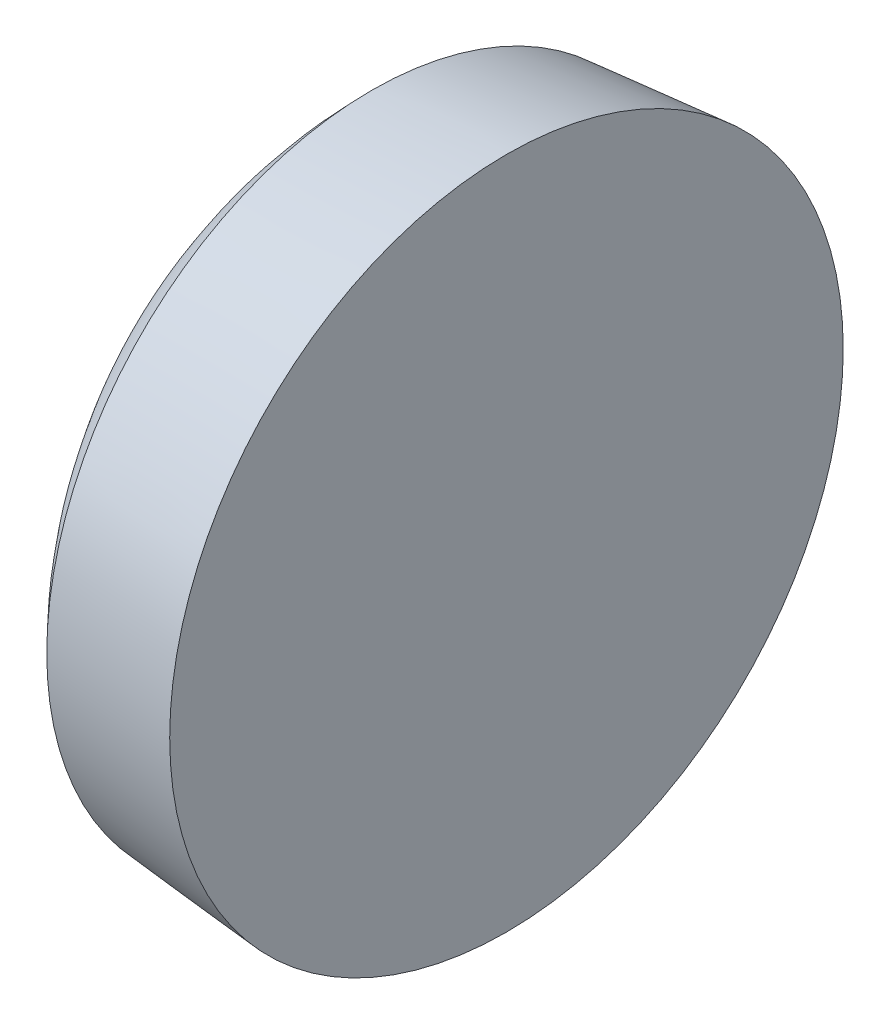
ISO-10303-21;
HEADER;
FILE_DESCRIPTION(('STEP AP214'),'2;1');
FILE_NAME('part.step','',(''),(''),'','','');
FILE_SCHEMA(('AUTOMOTIVE_DESIGN { 1 0 10303 214 1 1 1 1 }'));
ENDSEC;
DATA;
#1=APPLICATION_CONTEXT('core data for automotive mechanical design processes');
#2=APPLICATION_PROTOCOL_DEFINITION('international standard','automotive_design',2000,#1);
#3=PRODUCT_CONTEXT('',#1,'mechanical');
#4=PRODUCT('Part','Part','',(#3));
#5=PRODUCT_RELATED_PRODUCT_CATEGORY('part','',(#4));
#6=PRODUCT_DEFINITION_FORMATION('','',#4);
#7=PRODUCT_DEFINITION_CONTEXT('part definition',#1,'design');
#8=PRODUCT_DEFINITION('design','',#6,#7);
#9=PRODUCT_DEFINITION_SHAPE('','',#8);
#10=(LENGTH_UNIT() NAMED_UNIT(*) SI_UNIT(.MILLI.,.METRE.));
#11=(NAMED_UNIT(*) PLANE_ANGLE_UNIT() SI_UNIT($,.RADIAN.));
#12=(NAMED_UNIT(*) SI_UNIT($,.STERADIAN.) SOLID_ANGLE_UNIT());
#13=UNCERTAINTY_MEASURE_WITH_UNIT(LENGTH_MEASURE(1.E-05),#10,'distance_accuracy_value','');
#14=(GEOMETRIC_REPRESENTATION_CONTEXT(3) GLOBAL_UNCERTAINTY_ASSIGNED_CONTEXT((#13)) GLOBAL_UNIT_ASSIGNED_CONTEXT((#10,
#11,#12)) REPRESENTATION_CONTEXT('',''));
#15=CARTESIAN_POINT('',(0.,0.,0.));
#16=DIRECTION('',(0.,0.,1.));
#17=DIRECTION('',(1.,0.,0.));
#18=AXIS2_PLACEMENT_3D('',#15,#16,#17);
#19=CARTESIAN_POINT('',(183.433333333333,-6.9,10.));
#20=DIRECTION('',(-1.,0.,0.));
#21=DIRECTION('',(0.,0.,1.));
#22=AXIS2_PLACEMENT_3D('',#19,#20,#21);
#23=PLANE('',#22);
#24=DIRECTION('',(0.,0.,-1.));
#25=VECTOR('',#24,1.);
#26=CARTESIAN_POINT('',(183.433333333333,-5.95,10.));
#27=LINE('',#26,#25);
#28=CARTESIAN_POINT('',(183.433333333333,-5.95,9.82));
#29=VERTEX_POINT('',#28);
#30=CARTESIAN_POINT('',(183.433333333333,-5.95,10.18));
#31=VERTEX_POINT('',#30);
#32=EDGE_CURVE('E293',#29,#31,#27,.F.);
#33=ORIENTED_EDGE('',*,*,#32,.F.);
#34=DIRECTION('',(0.,1.,0.));
#35=VECTOR('',#34,1.);
#36=CARTESIAN_POINT('',(183.433333333333,-6.9,9.82));
#37=LINE('',#36,#35);
#38=CARTESIAN_POINT('',(183.433333333333,-6.72,9.82));
#39=VERTEX_POINT('',#38);
#40=EDGE_CURVE('E298',#39,#29,#37,.T.);
#41=ORIENTED_EDGE('',*,*,#40,.F.);
#42=DIRECTION('',(0.,0.,-1.));
#43=VECTOR('',#42,1.);
#44=CARTESIAN_POINT('',(183.433333333333,-6.72,10.));
#45=LINE('',#44,#43);
#46=CARTESIAN_POINT('',(183.433333333333,-6.72,9.05));
#47=VERTEX_POINT('',#46);
#48=EDGE_CURVE('E303',#47,#39,#45,.F.);
#49=ORIENTED_EDGE('',*,*,#48,.F.);
#50=DIRECTION('',(0.,1.,0.));
#51=VECTOR('',#50,1.);
#52=CARTESIAN_POINT('',(183.433333333333,-6.9,9.05));
#53=LINE('',#52,#51);
#54=CARTESIAN_POINT('',(183.433333333333,-7.08,9.05));
#55=VERTEX_POINT('',#54);
#56=EDGE_CURVE('E308',#55,#47,#53,.T.);
#57=ORIENTED_EDGE('',*,*,#56,.F.);
#58=DIRECTION('',(0.,0.,1.));
#59=VECTOR('',#58,1.);
#60=CARTESIAN_POINT('',(183.433333333333,-7.08,10.));
#61=LINE('',#60,#59);
#62=CARTESIAN_POINT('',(183.433333333333,-7.08,9.82));
#63=VERTEX_POINT('',#62);
#64=EDGE_CURVE('E313',#63,#55,#61,.F.);
#65=ORIENTED_EDGE('',*,*,#64,.F.);
#66=DIRECTION('',(0.,1.,0.));
#67=VECTOR('',#66,1.);
#68=CARTESIAN_POINT('',(183.433333333333,-6.9,9.82));
#69=LINE('',#68,#67);
#70=CARTESIAN_POINT('',(183.433333333333,-7.85,9.82));
#71=VERTEX_POINT('',#70);
#72=EDGE_CURVE('E318',#71,#63,#69,.T.);
#73=ORIENTED_EDGE('',*,*,#72,.F.);
#74=DIRECTION('',(0.,0.,-1.));
#75=VECTOR('',#74,1.);
#76=CARTESIAN_POINT('',(183.433333333333,-7.85,10.));
#77=LINE('',#76,#75);
#78=CARTESIAN_POINT('',(183.433333333333,-7.85,10.18));
#79=VERTEX_POINT('',#78);
#80=EDGE_CURVE('E267',#71,#79,#77,.F.);
#81=ORIENTED_EDGE('',*,*,#80,.T.);
#82=DIRECTION('',(0.,1.,0.));
#83=VECTOR('',#82,1.);
#84=CARTESIAN_POINT('',(183.433333333333,-6.9,10.18));
#85=LINE('',#84,#83);
#86=CARTESIAN_POINT('',(183.433333333333,-7.08,10.18));
#87=VERTEX_POINT('',#86);
#88=EDGE_CURVE('E264',#87,#79,#85,.F.);
#89=ORIENTED_EDGE('',*,*,#88,.F.);
#90=DIRECTION('',(0.,0.,1.));
#91=VECTOR('',#90,1.);
#92=CARTESIAN_POINT('',(183.433333333333,-7.08,10.));
#93=LINE('',#92,#91);
#94=CARTESIAN_POINT('',(183.433333333333,-7.08,10.95));
#95=VERTEX_POINT('',#94);
#96=EDGE_CURVE('E260',#95,#87,#93,.F.);
#97=ORIENTED_EDGE('',*,*,#96,.F.);
#98=DIRECTION('',(0.,1.,0.));
#99=VECTOR('',#98,1.);
#100=CARTESIAN_POINT('',(183.433333333333,-6.9,10.95));
#101=LINE('',#100,#99);
#102=CARTESIAN_POINT('',(183.433333333333,-6.72,10.95));
#103=VERTEX_POINT('',#102);
#104=EDGE_CURVE('E231',#95,#103,#101,.T.);
#105=ORIENTED_EDGE('',*,*,#104,.T.);
#106=DIRECTION('',(0.,0.,-1.));
#107=VECTOR('',#106,1.);
#108=CARTESIAN_POINT('',(183.433333333333,-6.72,10.));
#109=LINE('',#108,#107);
#110=CARTESIAN_POINT('',(183.433333333333,-6.72,10.18));
#111=VERTEX_POINT('',#110);
#112=EDGE_CURVE('E278',#111,#103,#109,.F.);
#113=ORIENTED_EDGE('',*,*,#112,.F.);
#114=DIRECTION('',(0.,1.,0.));
#115=VECTOR('',#114,1.);
#116=CARTESIAN_POINT('',(183.433333333333,-6.9,10.18));
#117=LINE('',#116,#115);
#118=EDGE_CURVE('E288',#31,#111,#117,.F.);
#119=ORIENTED_EDGE('',*,*,#118,.F.);
#120=EDGE_LOOP('',(#33,#41,#49,#57,#65,#73,#81,#89,#97,#105,#113,#119));
#121=FACE_BOUND('',#120,.T.);
#122=ADVANCED_FACE('F17',(#121),#23,.T.);
#123=CARTESIAN_POINT('',(182.833333333333,-7.08,10.));
#124=DIRECTION('',(0.,1.,0.));
#125=DIRECTION('',(0.,0.,1.));
#126=AXIS2_PLACEMENT_3D('',#123,#124,#125);
#127=PLANE('',#126);
#128=DIRECTION('',(1.,0.,0.));
#129=VECTOR('',#128,1.);
#130=CARTESIAN_POINT('',(182.833333333333,-7.08,10.95));
#131=LINE('',#130,#129);
#132=CARTESIAN_POINT('',(182.410428810142,-7.08,10.9499999999999));
#133=VERTEX_POINT('',#132);
#134=EDGE_CURVE('E89',#133,#95,#131,.T.);
#135=ORIENTED_EDGE('',*,*,#134,.T.);
#136=ORIENTED_EDGE('',*,*,#96,.T.);
#137=DIRECTION('',(-1.,0.,0.));
#138=VECTOR('',#137,1.);
#139=CARTESIAN_POINT('',(182.833333333333,-7.08,10.18));
#140=LINE('',#139,#138);
#141=CARTESIAN_POINT('',(182.245235763539,-7.07999999999998,10.18));
#142=VERTEX_POINT('',#141);
#143=EDGE_CURVE('E224',#142,#87,#140,.F.);
#144=ORIENTED_EDGE('',*,*,#143,.F.);
#145=CARTESIAN_POINT('',(182.410428810142,-7.08,10.9499999999998));
#146=CARTESIAN_POINT('',(182.398883795949,-7.08,10.9189995540504));
#147=CARTESIAN_POINT('',(182.387904413565,-7.08,10.8877884938066));
#148=CARTESIAN_POINT('',(182.367131215027,-7.08,10.8251104536467));
#149=CARTESIAN_POINT('',(182.357332908016,-7.08,10.7936449620739));
#150=CARTESIAN_POINT('',(182.338909367376,-7.08,10.7304618501355));
#151=CARTESIAN_POINT('',(182.330281127747,-7.08,10.6987451062671));
#152=CARTESIAN_POINT('',(182.31418937858,-7.08,10.6350619663154));
#153=CARTESIAN_POINT('',(182.306724349758,-7.08,10.6030959541241));
#154=CARTESIAN_POINT('',(182.292955171372,-7.08,10.5389148788567));
#155=CARTESIAN_POINT('',(182.286651021807,-7.08,10.5066998157807));
#156=CARTESIAN_POINT('',(182.275204274441,-7.08,10.4420201537523));
#157=CARTESIAN_POINT('',(182.270063219696,-7.08,10.4095552817085));
#158=CARTESIAN_POINT('',(182.260948171023,-7.08,10.3443751591892));
#159=CARTESIAN_POINT('',(182.256977278094,-7.08,10.3116594750372));
#160=CARTESIAN_POINT('',(182.250212291185,-7.08,10.2459761632456));
#161=CARTESIAN_POINT('',(182.247422903366,-7.08,10.2130080508537));
#162=CARTESIAN_POINT('',(182.24523576354,-7.08,10.18));
#163=B_SPLINE_CURVE_WITH_KNOTS('',3,(#145,#146,#147,#148,#149,#150,#151,#152,#153,#154,#155,
#156,#157,#158,#159,#160,#161,#162),.UNSPECIFIED.,.F.,.F.,(4,2,2,2,2,2,2,2,4),(0.,
0.099235744243404,0.198081387639237,0.296668072480432,0.395124892694019,0.493581712907607,
0.592168397748808,0.69101404114464,0.790249785388043),.UNSPECIFIED.);
#164=EDGE_CURVE('E20',#133,#142,#163,.T.);
#165=ORIENTED_EDGE('',*,*,#164,.F.);
#166=EDGE_LOOP('',(#135,#136,#144,#165));
#167=FACE_BOUND('',#166,.T.);
#168=ADVANCED_FACE('F221',(#167),#127,.T.);
#169=CARTESIAN_POINT('',(182.833333333333,-6.9,10.18));
#170=DIRECTION('',(0.,0.,-1.));
#171=DIRECTION('',(-1.,0.,0.));
#172=AXIS2_PLACEMENT_3D('',#169,#170,#171);
#173=PLANE('',#172);
#174=ORIENTED_EDGE('',*,*,#88,.T.);
#175=DIRECTION('',(1.,0.,0.));
#176=VECTOR('',#175,1.);
#177=CARTESIAN_POINT('',(182.833333333333,-7.85,10.18));
#178=LINE('',#177,#176);
#179=CARTESIAN_POINT('',(182.410428810142,-7.85,10.18));
#180=VERTEX_POINT('',#179);
#181=EDGE_CURVE('E324',#79,#180,#178,.F.);
#182=ORIENTED_EDGE('',*,*,#181,.T.);
#183=CARTESIAN_POINT('',(182.24523576354,-7.07999999999996,10.18));
#184=CARTESIAN_POINT('',(182.250889942228,-7.16559008255576,10.18));
#185=CARTESIAN_POINT('',(182.260621429629,-7.25090347737762,10.18));
#186=CARTESIAN_POINT('',(182.287988547145,-7.4196590615976,10.18));
#187=CARTESIAN_POINT('',(182.305570101184,-7.50311001948186,10.18));
#188=CARTESIAN_POINT('',(182.350299230746,-7.67504249159033,10.18));
#189=CARTESIAN_POINT('',(182.378135293842,-7.7633453110033,10.18));
#190=CARTESIAN_POINT('',(182.410428810142,-7.84999999999982,10.18));
#191=B_SPLINE_CURVE_WITH_KNOTS('',3,(#183,#184,#185,#186,#187,#188,#189,#190),.UNSPECIFIED.,.F.,
.F.,(4,2,2,4),(0.,0.25722165882931,0.51269811773729,0.789983486231458),.UNSPECIFIED.);
#192=EDGE_CURVE('E213',#142,#180,#191,.T.);
#193=ORIENTED_EDGE('',*,*,#192,.F.);
#194=ORIENTED_EDGE('',*,*,#143,.T.);
#195=EDGE_LOOP('',(#174,#182,#193,#194));
#196=FACE_BOUND('',#195,.T.);
#197=ADVANCED_FACE('F204',(#196),#173,.T.);
#198=CARTESIAN_POINT('',(182.833333333333,-7.85,10.));
#199=DIRECTION('',(0.,-1.,0.));
#200=DIRECTION('',(0.,0.,-1.));
#201=AXIS2_PLACEMENT_3D('',#198,#199,#200);
#202=PLANE('',#201);
#203=ORIENTED_EDGE('',*,*,#181,.F.);
#204=ORIENTED_EDGE('',*,*,#80,.F.);
#205=DIRECTION('',(1.,0.,0.));
#206=VECTOR('',#205,1.);
#207=CARTESIAN_POINT('',(182.833333333333,-7.85,9.82));
#208=LINE('',#207,#206);
#209=CARTESIAN_POINT('',(182.410428810142,-7.84999999999991,9.82));
#210=VERTEX_POINT('',#209);
#211=EDGE_CURVE('E320',#210,#71,#208,.T.);
#212=ORIENTED_EDGE('',*,*,#211,.F.);
#213=CARTESIAN_POINT('',(182.410428810143,-7.85,10.18));
#214=CARTESIAN_POINT('',(182.406200414444,-7.85000000000002,10.12));
#215=CARTESIAN_POINT('',(182.404086216595,-7.85000000000002,10.06));
#216=CARTESIAN_POINT('',(182.404086216595,-7.84999999999998,9.93999999999997));
#217=CARTESIAN_POINT('',(182.406200414444,-7.84999999999994,9.87999999999998));
#218=CARTESIAN_POINT('',(182.410428810143,-7.84999999999989,9.81999999999998));
#219=B_SPLINE_CURVE_WITH_KNOTS('',3,(#213,#214,#215,#216,#217,#218),.UNSPECIFIED.,.F.,.F.,(4,2,
4),(0.,0.180111711148681,0.36022342229736),.UNSPECIFIED.);
#220=EDGE_CURVE('E207',#180,#210,#219,.T.);
#221=ORIENTED_EDGE('',*,*,#220,.F.);
#222=EDGE_LOOP('',(#203,#204,#212,#221));
#223=FACE_BOUND('',#222,.T.);
#224=ADVANCED_FACE('F199',(#223),#202,.F.);
#225=CARTESIAN_POINT('',(182.833333333333,-6.9,9.82));
#226=DIRECTION('',(0.,0.,1.));
#227=DIRECTION('',(1.,0.,0.));
#228=AXIS2_PLACEMENT_3D('',#225,#226,#227);
#229=PLANE('',#228);
#230=ORIENTED_EDGE('',*,*,#72,.T.);
#231=DIRECTION('',(1.,0.,0.));
#232=VECTOR('',#231,1.);
#233=CARTESIAN_POINT('',(182.833333333333,-7.08,9.82));
#234=LINE('',#233,#232);
#235=CARTESIAN_POINT('',(182.245235763539,-7.08,9.82000000000002));
#236=VERTEX_POINT('',#235);
#237=EDGE_CURVE('E315',#236,#63,#234,.T.);
#238=ORIENTED_EDGE('',*,*,#237,.F.);
#239=CARTESIAN_POINT('',(182.410428810142,-7.84999999999982,9.82));
#240=CARTESIAN_POINT('',(182.398883795949,-7.8189995540504,9.82));
#241=CARTESIAN_POINT('',(182.387904413565,-7.78778849380655,9.82));
#242=CARTESIAN_POINT('',(182.367131215027,-7.72511045364668,9.82));
#243=CARTESIAN_POINT('',(182.357332908016,-7.69364496207389,9.82));
#244=CARTESIAN_POINT('',(182.338909367376,-7.63046185013545,9.82));
#245=CARTESIAN_POINT('',(182.330281127747,-7.5987451062671,9.82));
#246=CARTESIAN_POINT('',(182.31418937858,-7.53506196631538,9.82));
#247=CARTESIAN_POINT('',(182.306724349758,-7.50309595412406,9.82));
#248=CARTESIAN_POINT('',(182.292955171372,-7.43891487885671,9.82));
#249=CARTESIAN_POINT('',(182.286651021807,-7.40669981578069,9.82));
#250=CARTESIAN_POINT('',(182.275204274441,-7.3420201537523,9.82));
#251=CARTESIAN_POINT('',(182.270063219696,-7.30955528170848,9.82));
#252=CARTESIAN_POINT('',(182.260948171023,-7.24437515918925,9.82));
#253=CARTESIAN_POINT('',(182.256977278094,-7.21165947503717,9.82));
#254=CARTESIAN_POINT('',(182.250212291185,-7.14597616324555,9.82));
#255=CARTESIAN_POINT('',(182.247422903366,-7.11300805085374,9.82));
#256=CARTESIAN_POINT('',(182.24523576354,-7.07999999999996,9.82));
#257=B_SPLINE_CURVE_WITH_KNOTS('',3,(#239,#240,#241,#242,#243,#244,#245,#246,#247,#248,#249,
#250,#251,#252,#253,#254,#255,#256),.UNSPECIFIED.,.F.,.F.,(4,2,2,2,2,2,2,2,4),(0.,
0.0992357442434032,0.198081387639238,0.296668072480432,0.395124892694019,0.493581712907607,
0.592168397748809,0.691014041144643,0.790249785388045),.UNSPECIFIED.);
#258=EDGE_CURVE('E184',#210,#236,#257,.T.);
#259=ORIENTED_EDGE('',*,*,#258,.F.);
#260=ORIENTED_EDGE('',*,*,#211,.T.);
#261=EDGE_LOOP('',(#230,#238,#259,#260));
#262=FACE_BOUND('',#261,.T.);
#263=ADVANCED_FACE('F194',(#262),#229,.T.);
#264=CARTESIAN_POINT('',(182.833333333333,-7.08,10.));
#265=DIRECTION('',(0.,1.,0.));
#266=DIRECTION('',(0.,0.,1.));
#267=AXIS2_PLACEMENT_3D('',#264,#265,#266);
#268=PLANE('',#267);
#269=DIRECTION('',(1.,0.,0.));
#270=VECTOR('',#269,1.);
#271=CARTESIAN_POINT('',(182.833333333333,-7.08,9.05));
#272=LINE('',#271,#270);
#273=CARTESIAN_POINT('',(182.410428810142,-7.08,9.05));
#274=VERTEX_POINT('',#273);
#275=EDGE_CURVE('E310',#274,#55,#272,.T.);
#276=ORIENTED_EDGE('',*,*,#275,.F.);
#277=CARTESIAN_POINT('',(182.24523576354,-7.08,9.82000000000004));
#278=CARTESIAN_POINT('',(182.250889942228,-7.08,9.73440991744424));
#279=CARTESIAN_POINT('',(182.260621429629,-7.08,9.64909652262238));
#280=CARTESIAN_POINT('',(182.287988547145,-7.08,9.4803409384024));
#281=CARTESIAN_POINT('',(182.305570101184,-7.08,9.39688998051814));
#282=CARTESIAN_POINT('',(182.350299230746,-7.08,9.22495750840967));
#283=CARTESIAN_POINT('',(182.378135293842,-7.08,9.1366546889967));
#284=CARTESIAN_POINT('',(182.410428810142,-7.08,9.05000000000019));
#285=B_SPLINE_CURVE_WITH_KNOTS('',3,(#277,#278,#279,#280,#281,#282,#283,#284),.UNSPECIFIED.,.F.,
.F.,(4,2,2,4),(0.,0.25722165882931,0.512698117737291,0.789983486231457),.UNSPECIFIED.);
#286=EDGE_CURVE('E176',#236,#274,#285,.T.);
#287=ORIENTED_EDGE('',*,*,#286,.F.);
#288=ORIENTED_EDGE('',*,*,#237,.T.);
#289=ORIENTED_EDGE('',*,*,#64,.T.);
#290=EDGE_LOOP('',(#276,#287,#288,#289));
#291=FACE_BOUND('',#290,.T.);
#292=ADVANCED_FACE('F191',(#291),#268,.T.);
#293=CARTESIAN_POINT('',(182.833333333333,-6.9,9.05));
#294=DIRECTION('',(0.,0.,1.));
#295=DIRECTION('',(1.,0.,0.));
#296=AXIS2_PLACEMENT_3D('',#293,#294,#295);
#297=PLANE('',#296);
#298=DIRECTION('',(1.,0.,0.));
#299=VECTOR('',#298,1.);
#300=CARTESIAN_POINT('',(182.833333333333,-6.72,9.05));
#301=LINE('',#300,#299);
#302=CARTESIAN_POINT('',(182.410428810142,-6.72,9.05000000000009));
#303=VERTEX_POINT('',#302);
#304=EDGE_CURVE('E305',#303,#47,#301,.T.);
#305=ORIENTED_EDGE('',*,*,#304,.F.);
#306=CARTESIAN_POINT('',(182.410428810142,-6.72,9.05));
#307=CARTESIAN_POINT('',(182.404086216595,-6.80988825418755,9.05));
#308=CARTESIAN_POINT('',(182.404086216595,-6.9,9.05));
#309=B_SPLINE_CURVE_WITH_KNOTS('',2,(#306,#307,#308),.UNSPECIFIED.,.F.,.F.,(3,3),(0.,1.),.UNSPECIFIED.);
#310=CARTESIAN_POINT('',(182.404086216595,-6.9,9.05));
#311=VERTEX_POINT('',#310);
#312=EDGE_CURVE('E175',#311,#303,#309,.F.);
#313=ORIENTED_EDGE('',*,*,#312,.F.);
#314=CARTESIAN_POINT('',(182.404086216595,-6.9,9.05));
#315=CARTESIAN_POINT('',(182.404086216595,-6.99011174581245,9.05));
#316=CARTESIAN_POINT('',(182.410428810142,-7.08,9.05));
#317=B_SPLINE_CURVE_WITH_KNOTS('',2,(#314,#315,#316),.UNSPECIFIED.,.F.,.F.,(3,3),(0.,1.),.UNSPECIFIED.);
#318=EDGE_CURVE('E183',#274,#311,#317,.F.);
#319=ORIENTED_EDGE('',*,*,#318,.F.);
#320=ORIENTED_EDGE('',*,*,#275,.T.);
#321=ORIENTED_EDGE('',*,*,#56,.T.);
#322=EDGE_LOOP('',(#305,#313,#319,#320,#321));
#323=FACE_BOUND('',#322,.T.);
#324=ADVANCED_FACE('F164',(#323),#297,.T.);
#325=CARTESIAN_POINT('',(182.833333333333,-6.72,10.));
#326=DIRECTION('',(0.,-1.,0.));
#327=DIRECTION('',(0.,0.,-1.));
#328=AXIS2_PLACEMENT_3D('',#325,#326,#327);
#329=PLANE('',#328);
#330=ORIENTED_EDGE('',*,*,#304,.T.);
#331=ORIENTED_EDGE('',*,*,#48,.T.);
#332=DIRECTION('',(1.,0.,0.));
#333=VECTOR('',#332,1.);
#334=CARTESIAN_POINT('',(182.833333333333,-6.72,9.82));
#335=LINE('',#334,#333);
#336=CARTESIAN_POINT('',(182.245235763539,-6.72000000000002,9.82));
#337=VERTEX_POINT('',#336);
#338=EDGE_CURVE('E300',#337,#39,#335,.T.);
#339=ORIENTED_EDGE('',*,*,#338,.F.);
#340=CARTESIAN_POINT('',(182.410428810142,-6.72,9.05000000000019));
#341=CARTESIAN_POINT('',(182.398883795949,-6.72,9.0810004459496));
#342=CARTESIAN_POINT('',(182.387904413565,-6.72,9.11221150619345));
#343=CARTESIAN_POINT('',(182.367131215027,-6.72,9.17488954635332));
#344=CARTESIAN_POINT('',(182.357332908016,-6.72,9.20635503792611));
#345=CARTESIAN_POINT('',(182.338909367376,-6.72,9.26953814986455));
#346=CARTESIAN_POINT('',(182.330281127747,-6.72,9.3012548937329));
#347=CARTESIAN_POINT('',(182.31418937858,-6.72,9.36493803368462));
#348=CARTESIAN_POINT('',(182.306724349758,-6.72,9.39690404587594));
#349=CARTESIAN_POINT('',(182.292955171372,-6.72,9.46108512114329));
#350=CARTESIAN_POINT('',(182.286651021807,-6.72,9.49330018421931));
#351=CARTESIAN_POINT('',(182.275204274441,-6.72,9.5579798462477));
#352=CARTESIAN_POINT('',(182.270063219696,-6.72,9.59044471829152));
#353=CARTESIAN_POINT('',(182.260948171023,-6.72,9.65562484081075));
#354=CARTESIAN_POINT('',(182.256977278094,-6.72,9.68834052496284));
#355=CARTESIAN_POINT('',(182.250212291185,-6.72,9.75402383675445));
#356=CARTESIAN_POINT('',(182.247422903366,-6.72,9.78699194914626));
#357=CARTESIAN_POINT('',(182.24523576354,-6.72,9.82000000000004));
#358=B_SPLINE_CURVE_WITH_KNOTS('',3,(#340,#341,#342,#343,#344,#345,#346,#347,#348,#349,#350,
#351,#352,#353,#354,#355,#356,#357),.UNSPECIFIED.,.F.,.F.,(4,2,2,2,2,2,2,2,4),(0.,
0.0992357442434024,0.198081387639237,0.296668072480432,0.395124892694019,0.493581712907605,
0.592168397748809,0.691014041144642,0.790249785388043),.UNSPECIFIED.);
#359=EDGE_CURVE('E168',#303,#337,#358,.T.);
#360=ORIENTED_EDGE('',*,*,#359,.F.);
#361=EDGE_LOOP('',(#330,#331,#339,#360));
#362=FACE_BOUND('',#361,.T.);
#363=ADVANCED_FACE('F159',(#362),#329,.T.);
#364=CARTESIAN_POINT('',(182.833333333333,-6.9,9.82));
#365=DIRECTION('',(0.,0.,1.));
#366=DIRECTION('',(1.,0.,0.));
#367=AXIS2_PLACEMENT_3D('',#364,#365,#366);
#368=PLANE('',#367);
#369=ORIENTED_EDGE('',*,*,#40,.T.);
#370=DIRECTION('',(1.,0.,0.));
#371=VECTOR('',#370,1.);
#372=CARTESIAN_POINT('',(182.833333333333,-5.95,9.82));
#373=LINE('',#372,#371);
#374=CARTESIAN_POINT('',(182.410428810142,-5.95,9.82000000000002));
#375=VERTEX_POINT('',#374);
#376=EDGE_CURVE('E295',#375,#29,#373,.T.);
#377=ORIENTED_EDGE('',*,*,#376,.F.);
#378=CARTESIAN_POINT('',(182.24523576354,-6.72000000000004,9.82));
#379=CARTESIAN_POINT('',(182.250889942228,-6.63440991744424,9.82));
#380=CARTESIAN_POINT('',(182.260621429629,-6.54909652262238,9.82));
#381=CARTESIAN_POINT('',(182.287988547145,-6.3803409384024,9.82));
#382=CARTESIAN_POINT('',(182.305570101184,-6.29688998051813,9.82));
#383=CARTESIAN_POINT('',(182.350299230746,-6.12495750840967,9.82));
#384=CARTESIAN_POINT('',(182.378135293842,-6.0366546889967,9.82));
#385=CARTESIAN_POINT('',(182.410428810142,-5.95000000000018,9.82));
#386=B_SPLINE_CURVE_WITH_KNOTS('',3,(#378,#379,#380,#381,#382,#383,#384,#385),.UNSPECIFIED.,.F.,
.F.,(4,2,2,4),(0.,0.25722165882931,0.512698117737291,0.789983486231458),.UNSPECIFIED.);
#387=EDGE_CURVE('E144',#337,#375,#386,.T.);
#388=ORIENTED_EDGE('',*,*,#387,.F.);
#389=ORIENTED_EDGE('',*,*,#338,.T.);
#390=EDGE_LOOP('',(#369,#377,#388,#389));
#391=FACE_BOUND('',#390,.T.);
#392=ADVANCED_FACE('F154',(#391),#368,.T.);
#393=CARTESIAN_POINT('',(182.833333333333,-5.95,10.));
#394=DIRECTION('',(0.,-1.,0.));
#395=DIRECTION('',(0.,0.,-1.));
#396=AXIS2_PLACEMENT_3D('',#393,#394,#395);
#397=PLANE('',#396);
#398=ORIENTED_EDGE('',*,*,#32,.T.);
#399=DIRECTION('',(-1.,0.,0.));
#400=VECTOR('',#399,1.);
#401=CARTESIAN_POINT('',(182.833333333333,-5.95,10.18));
#402=LINE('',#401,#400);
#403=CARTESIAN_POINT('',(182.410428810142,-5.95000000000009,10.18));
#404=VERTEX_POINT('',#403);
#405=EDGE_CURVE('E290',#404,#31,#402,.F.);
#406=ORIENTED_EDGE('',*,*,#405,.F.);
#407=CARTESIAN_POINT('',(182.410428810143,-5.95,9.82000000000004));
#408=CARTESIAN_POINT('',(182.406200414444,-5.94999999999999,9.88000000000004));
#409=CARTESIAN_POINT('',(182.404086216595,-5.94999999999999,9.94000000000003));
#410=CARTESIAN_POINT('',(182.404086216595,-5.95000000000001,10.06));
#411=CARTESIAN_POINT('',(182.406200414444,-5.95000000000003,10.12));
#412=CARTESIAN_POINT('',(182.410428810143,-5.95000000000006,10.18));
#413=B_SPLINE_CURVE_WITH_KNOTS('',3,(#407,#408,#409,#410,#411,#412),.UNSPECIFIED.,.F.,.F.,(4,2,
4),(0.,0.180111711148681,0.36022342229736),.UNSPECIFIED.);
#414=EDGE_CURVE('E137',#375,#404,#413,.T.);
#415=ORIENTED_EDGE('',*,*,#414,.F.);
#416=ORIENTED_EDGE('',*,*,#376,.T.);
#417=EDGE_LOOP('',(#398,#406,#415,#416));
#418=FACE_BOUND('',#417,.T.);
#419=ADVANCED_FACE('F151',(#418),#397,.T.);
#420=CARTESIAN_POINT('',(182.833333333333,-6.9,10.18));
#421=DIRECTION('',(0.,0.,-1.));
#422=DIRECTION('',(-1.,0.,0.));
#423=AXIS2_PLACEMENT_3D('',#420,#421,#422);
#424=PLANE('',#423);
#425=ORIENTED_EDGE('',*,*,#118,.T.);
#426=DIRECTION('',(1.,0.,0.));
#427=VECTOR('',#426,1.);
#428=CARTESIAN_POINT('',(182.833333333333,-6.72,10.18));
#429=LINE('',#428,#427);
#430=CARTESIAN_POINT('',(182.245235763539,-6.72,10.18));
#431=VERTEX_POINT('',#430);
#432=EDGE_CURVE('E280',#431,#111,#429,.T.);
#433=ORIENTED_EDGE('',*,*,#432,.F.);
#434=CARTESIAN_POINT('',(182.410428810142,-5.95000000000018,10.18));
#435=CARTESIAN_POINT('',(182.398883795949,-5.9810004459496,10.18));
#436=CARTESIAN_POINT('',(182.387904413565,-6.01221150619345,10.18));
#437=CARTESIAN_POINT('',(182.367131215027,-6.07488954635332,10.18));
#438=CARTESIAN_POINT('',(182.357332908016,-6.10635503792611,10.18));
#439=CARTESIAN_POINT('',(182.338909367376,-6.16953814986455,10.18));
#440=CARTESIAN_POINT('',(182.330281127747,-6.20125489373289,10.18));
#441=CARTESIAN_POINT('',(182.31418937858,-6.26493803368462,10.18));
#442=CARTESIAN_POINT('',(182.306724349758,-6.29690404587594,10.18));
#443=CARTESIAN_POINT('',(182.292955171372,-6.36108512114329,10.18));
#444=CARTESIAN_POINT('',(182.286651021807,-6.39330018421931,10.18));
#445=CARTESIAN_POINT('',(182.275204274441,-6.4579798462477,10.18));
#446=CARTESIAN_POINT('',(182.270063219696,-6.49044471829152,10.18));
#447=CARTESIAN_POINT('',(182.260948171023,-6.55562484081075,10.18));
#448=CARTESIAN_POINT('',(182.256977278094,-6.58834052496283,10.18));
#449=CARTESIAN_POINT('',(182.250212291185,-6.65402383675445,10.18));
#450=CARTESIAN_POINT('',(182.247422903366,-6.68699194914626,10.18));
#451=CARTESIAN_POINT('',(182.24523576354,-6.72000000000004,10.18));
#452=B_SPLINE_CURVE_WITH_KNOTS('',3,(#434,#435,#436,#437,#438,#439,#440,#441,#442,#443,#444,
#445,#446,#447,#448,#449,#450,#451),.UNSPECIFIED.,.F.,.F.,(4,2,2,2,2,2,2,2,4),(0.,
0.0992357442434032,0.198081387639237,0.296668072480432,0.395124892694019,0.493581712907607,
0.592168397748808,0.691014041144642,0.790249785388044),.UNSPECIFIED.);
#453=EDGE_CURVE('E100',#404,#431,#452,.T.);
#454=ORIENTED_EDGE('',*,*,#453,.F.);
#455=ORIENTED_EDGE('',*,*,#405,.T.);
#456=EDGE_LOOP('',(#425,#433,#454,#455));
#457=FACE_BOUND('',#456,.T.);
#458=ADVANCED_FACE('F123',(#457),#424,.T.);
#459=CARTESIAN_POINT('',(182.833333333333,-6.72,10.));
#460=DIRECTION('',(0.,-1.,0.));
#461=DIRECTION('',(0.,0.,-1.));
#462=AXIS2_PLACEMENT_3D('',#459,#460,#461);
#463=PLANE('',#462);
#464=DIRECTION('',(1.,0.,0.));
#465=VECTOR('',#464,1.);
#466=CARTESIAN_POINT('',(182.833333333333,-6.72,10.95));
#467=LINE('',#466,#465);
#468=CARTESIAN_POINT('',(182.410428810142,-6.72,10.95));
#469=VERTEX_POINT('',#468);
#470=EDGE_CURVE('E40',#103,#469,#467,.F.);
#471=ORIENTED_EDGE('',*,*,#470,.T.);
#472=CARTESIAN_POINT('',(182.24523576354,-6.72,10.18));
#473=CARTESIAN_POINT('',(182.250889942228,-6.72,10.2655900825558));
#474=CARTESIAN_POINT('',(182.260621429629,-6.72,10.3509034773776));
#475=CARTESIAN_POINT('',(182.287988547145,-6.72,10.5196590615976));
#476=CARTESIAN_POINT('',(182.305570101184,-6.72,10.6031100194819));
#477=CARTESIAN_POINT('',(182.350299230746,-6.72,10.7750424915903));
#478=CARTESIAN_POINT('',(182.378135293842,-6.72,10.8633453110033));
#479=CARTESIAN_POINT('',(182.410428810142,-6.72,10.9499999999998));
#480=B_SPLINE_CURVE_WITH_KNOTS('',3,(#472,#473,#474,#475,#476,#477,#478,#479),.UNSPECIFIED.,.F.,
.F.,(4,2,2,4),(0.,0.25722165882931,0.512698117737291,0.789983486231457),.UNSPECIFIED.);
#481=EDGE_CURVE('E96',#431,#469,#480,.T.);
#482=ORIENTED_EDGE('',*,*,#481,.F.);
#483=ORIENTED_EDGE('',*,*,#432,.T.);
#484=ORIENTED_EDGE('',*,*,#112,.T.);
#485=EDGE_LOOP('',(#471,#482,#483,#484));
#486=FACE_BOUND('',#485,.T.);
#487=ADVANCED_FACE('F115',(#486),#463,.T.);
#488=CARTESIAN_POINT('',(182.833333333333,-6.9,10.95));
#489=DIRECTION('',(0.,0.,1.));
#490=DIRECTION('',(1.,0.,0.));
#491=AXIS2_PLACEMENT_3D('',#488,#489,#490);
#492=PLANE('',#491);
#493=ORIENTED_EDGE('',*,*,#470,.F.);
#494=ORIENTED_EDGE('',*,*,#104,.F.);
#495=ORIENTED_EDGE('',*,*,#134,.F.);
#496=CARTESIAN_POINT('',(182.404086216595,-6.9,10.95));
#497=CARTESIAN_POINT('',(182.404086216595,-6.99011174581245,10.95));
#498=CARTESIAN_POINT('',(182.410428810142,-7.08,10.95));
#499=B_SPLINE_CURVE_WITH_KNOTS('',2,(#496,#497,#498),.UNSPECIFIED.,.F.,.F.,(3,3),(0.,1.),.UNSPECIFIED.);
#500=CARTESIAN_POINT('',(182.404086216595,-6.9,10.95));
#501=VERTEX_POINT('',#500);
#502=EDGE_CURVE('E82',#501,#133,#499,.T.);
#503=ORIENTED_EDGE('',*,*,#502,.F.);
#504=CARTESIAN_POINT('',(182.410428810142,-6.72,10.95));
#505=CARTESIAN_POINT('',(182.404086216595,-6.80988825418755,10.95));
#506=CARTESIAN_POINT('',(182.404086216595,-6.9,10.95));
#507=B_SPLINE_CURVE_WITH_KNOTS('',2,(#504,#505,#506),.UNSPECIFIED.,.F.,.F.,(3,3),(0.,1.),.UNSPECIFIED.);
#508=EDGE_CURVE('E85',#469,#501,#507,.T.);
#509=ORIENTED_EDGE('',*,*,#508,.F.);
#510=EDGE_LOOP('',(#493,#494,#495,#503,#509));
#511=FACE_BOUND('',#510,.T.);
#512=ADVANCED_FACE('F84',(#511),#492,.F.);
#513=CARTESIAN_POINT('',(184.96141771278,-6.9,10.));
#514=DIRECTION('',(1.,0.,0.));
#515=DIRECTION('',(0.,1.,0.));
#516=AXIS2_PLACEMENT_3D('',#513,#514,#515);
#517=SPHERICAL_SURFACE('',#516,2.72808437944638);
#518=CARTESIAN_POINT('',(183.033333333356,-6.9,10.));
#519=DIRECTION('',(1.,0.,0.));
#520=DIRECTION('',(0.,0.,1.));
#521=AXIS2_PLACEMENT_3D('',#518,#519,#520);
#522=CIRCLE('',#521,1.9300090691894);
#523=CARTESIAN_POINT('',(183.033333333356,-6.89999999999993,11.9300090691894));
#524=VERTEX_POINT('',#523);
#525=EDGE_CURVE('E31',#524,#524,#522,.T.);
#526=ORIENTED_EDGE('',*,*,#525,.F.);
#527=EDGE_LOOP('',(#526));
#528=FACE_BOUND('',#527,.T.);
#529=ORIENTED_EDGE('',*,*,#481,.T.);
#530=ORIENTED_EDGE('',*,*,#508,.T.);
#531=ORIENTED_EDGE('',*,*,#502,.T.);
#532=ORIENTED_EDGE('',*,*,#164,.T.);
#533=ORIENTED_EDGE('',*,*,#192,.T.);
#534=ORIENTED_EDGE('',*,*,#220,.T.);
#535=ORIENTED_EDGE('',*,*,#258,.T.);
#536=ORIENTED_EDGE('',*,*,#286,.T.);
#537=ORIENTED_EDGE('',*,*,#318,.T.);
#538=ORIENTED_EDGE('',*,*,#312,.T.);
#539=ORIENTED_EDGE('',*,*,#359,.T.);
#540=ORIENTED_EDGE('',*,*,#387,.T.);
#541=ORIENTED_EDGE('',*,*,#414,.T.);
#542=ORIENTED_EDGE('',*,*,#453,.T.);
#543=EDGE_LOOP('',(#529,#530,#531,#532,#533,#534,#535,#536,#537,#538,#539,#540,#541,#542));
#544=FACE_BOUND('',#543,.T.);
#545=ADVANCED_FACE('F94',(#528,#544),#517,.T.);
#546=CARTESIAN_POINT('',(183.833333333325,-6.9,10.));
#547=DIRECTION('',(1.,0.,0.));
#548=DIRECTION('',(0.,0.,-1.));
#549=AXIS2_PLACEMENT_3D('',#546,#547,#548);
#550=CONICAL_SURFACE('',#549,2.00000000000045,0.0872664625936403);
#551=CARTESIAN_POINT('',(183.833333333325,-6.9,10.));
#552=DIRECTION('',(1.,0.,0.));
#553=DIRECTION('',(0.,0.,-1.));
#554=AXIS2_PLACEMENT_3D('',#551,#552,#553);
#555=CIRCLE('',#554,2.00000000000045);
#556=CARTESIAN_POINT('',(183.833333333325,-6.9,7.99999999999955));
#557=VERTEX_POINT('',#556);
#558=EDGE_CURVE('E11',#557,#557,#555,.T.);
#559=ORIENTED_EDGE('',*,*,#558,.F.);
#560=EDGE_LOOP('',(#559));
#561=FACE_BOUND('',#560,.T.);
#562=ORIENTED_EDGE('',*,*,#525,.T.);
#563=EDGE_LOOP('',(#562));
#564=FACE_BOUND('',#563,.T.);
#565=ADVANCED_FACE('F402',(#561,#564),#550,.T.);
#566=CARTESIAN_POINT('',(183.833333333333,-6.9,11.));
#567=DIRECTION('',(1.,0.,0.));
#568=DIRECTION('',(0.,0.,-1.));
#569=AXIS2_PLACEMENT_3D('',#566,#567,#568);
#570=PLANE('',#569);
#571=ORIENTED_EDGE('',*,*,#558,.T.);
#572=EDGE_LOOP('',(#571));
#573=FACE_BOUND('',#572,.T.);
#574=ADVANCED_FACE('F400',(#573),#570,.T.);
#575=CLOSED_SHELL('',(#122,#168,#197,#224,#263,#292,#324,#363,#392,#419,#458,#487,#512,#545,
#565,#574));
#576=MANIFOLD_SOLID_BREP('B1',#575);
#577=ADVANCED_BREP_SHAPE_REPRESENTATION('',(#18,#576),#14);
#578=SHAPE_DEFINITION_REPRESENTATION(#9,#577);
ENDSEC;
END-ISO-10303-21;
